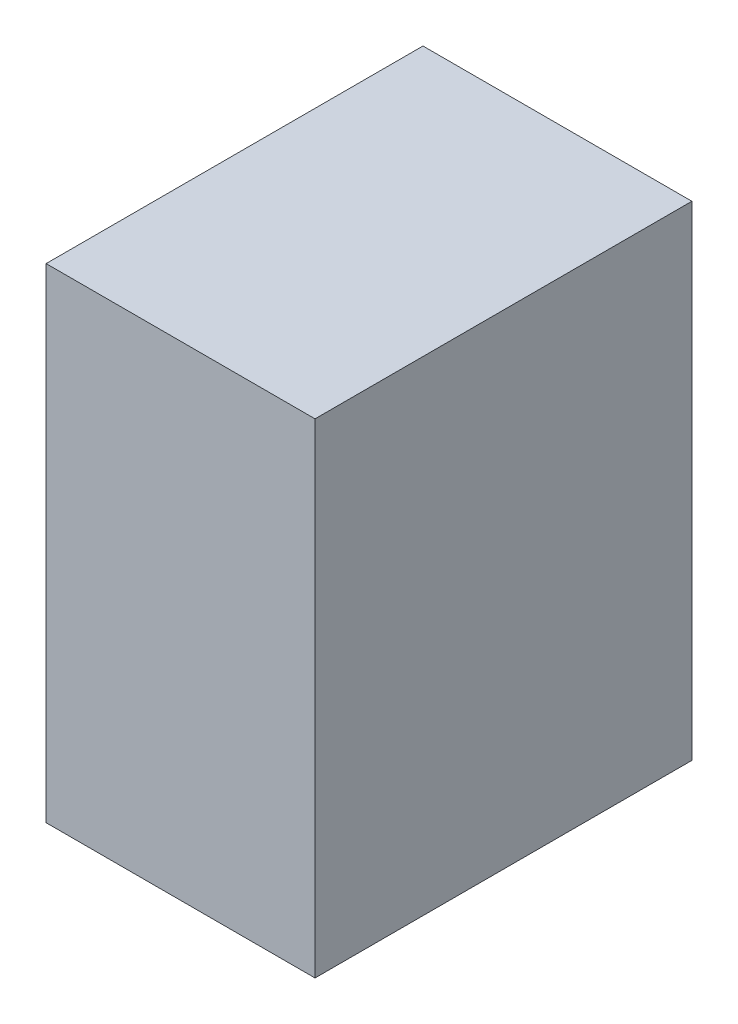
ISO-10303-21;
HEADER;
FILE_DESCRIPTION(('STEP AP214'),'2;1');
FILE_NAME('part.step','',(''),(''),'','','');
FILE_SCHEMA(('AUTOMOTIVE_DESIGN { 1 0 10303 214 1 1 1 1 }'));
ENDSEC;
DATA;
#1=APPLICATION_CONTEXT('core data for automotive mechanical design processes');
#2=APPLICATION_PROTOCOL_DEFINITION('international standard','automotive_design',2000,#1);
#3=PRODUCT_CONTEXT('',#1,'mechanical');
#4=PRODUCT('Part','Part','',(#3));
#5=PRODUCT_RELATED_PRODUCT_CATEGORY('part','',(#4));
#6=PRODUCT_DEFINITION_FORMATION('','',#4);
#7=PRODUCT_DEFINITION_CONTEXT('part definition',#1,'design');
#8=PRODUCT_DEFINITION('design','',#6,#7);
#9=PRODUCT_DEFINITION_SHAPE('','',#8);
#10=(LENGTH_UNIT() NAMED_UNIT(*) SI_UNIT(.MILLI.,.METRE.));
#11=(NAMED_UNIT(*) PLANE_ANGLE_UNIT() SI_UNIT($,.RADIAN.));
#12=(NAMED_UNIT(*) SI_UNIT($,.STERADIAN.) SOLID_ANGLE_UNIT());
#13=UNCERTAINTY_MEASURE_WITH_UNIT(LENGTH_MEASURE(1.E-05),#10,'distance_accuracy_value','');
#14=(GEOMETRIC_REPRESENTATION_CONTEXT(3) GLOBAL_UNCERTAINTY_ASSIGNED_CONTEXT((#13)) GLOBAL_UNIT_ASSIGNED_CONTEXT((#10,
#11,#12)) REPRESENTATION_CONTEXT('',''));
#15=CARTESIAN_POINT('',(0.,0.,0.));
#16=DIRECTION('',(0.,0.,1.));
#17=DIRECTION('',(1.,0.,0.));
#18=AXIS2_PLACEMENT_3D('',#15,#16,#17);
#19=CARTESIAN_POINT('',(-0.499491,0.89949274,1.39999974));
#20=DIRECTION('',(0.,0.,1.));
#21=DIRECTION('',(1.,0.,0.));
#22=AXIS2_PLACEMENT_3D('',#19,#20,#21);
#23=PLANE('',#22);
#24=DIRECTION('',(0.,1.,0.));
#25=VECTOR('',#24,1.);
#26=CARTESIAN_POINT('',(-0.499491,-0.89949274,1.39999974));
#27=LINE('',#26,#25);
#28=CARTESIAN_POINT('',(-0.499491,-0.89949274,1.39999974));
#29=VERTEX_POINT('',#28);
#30=CARTESIAN_POINT('',(-0.499491,0.89949274,1.39999974));
#31=VERTEX_POINT('',#30);
#32=EDGE_CURVE('E27',#29,#31,#27,.T.);
#33=ORIENTED_EDGE('',*,*,#32,.F.);
#34=DIRECTION('',(-1.,0.,0.));
#35=VECTOR('',#34,1.);
#36=CARTESIAN_POINT('',(0.499491,-0.89949274,1.39999974));
#37=LINE('',#36,#35);
#38=CARTESIAN_POINT('',(0.499491,-0.89949274,1.39999974));
#39=VERTEX_POINT('',#38);
#40=EDGE_CURVE('E108',#39,#29,#37,.T.);
#41=ORIENTED_EDGE('',*,*,#40,.F.);
#42=DIRECTION('',(0.,-1.,0.));
#43=VECTOR('',#42,1.);
#44=CARTESIAN_POINT('',(0.499491,0.89949274,1.39999974));
#45=LINE('',#44,#43);
#46=CARTESIAN_POINT('',(0.499491,0.89949274,1.39999974));
#47=VERTEX_POINT('',#46);
#48=EDGE_CURVE('E81',#47,#39,#45,.T.);
#49=ORIENTED_EDGE('',*,*,#48,.F.);
#50=DIRECTION('',(1.,0.,0.));
#51=VECTOR('',#50,1.);
#52=CARTESIAN_POINT('',(-0.499491,0.89949274,1.39999974));
#53=LINE('',#52,#51);
#54=EDGE_CURVE('E86',#31,#47,#53,.T.);
#55=ORIENTED_EDGE('',*,*,#54,.F.);
#56=EDGE_LOOP('',(#33,#41,#49,#55));
#57=FACE_BOUND('',#56,.T.);
#58=ADVANCED_FACE('F17',(#57),#23,.T.);
#59=CARTESIAN_POINT('',(-0.499491,0.89949274,0.));
#60=DIRECTION('',(0.,0.,1.));
#61=DIRECTION('',(1.,0.,0.));
#62=AXIS2_PLACEMENT_3D('',#59,#60,#61);
#63=PLANE('',#62);
#64=DIRECTION('',(1.,0.,0.));
#65=VECTOR('',#64,1.);
#66=CARTESIAN_POINT('',(-0.499491,0.89949274,0.));
#67=LINE('',#66,#65);
#68=CARTESIAN_POINT('',(-0.499491,0.89949274,0.));
#69=VERTEX_POINT('',#68);
#70=CARTESIAN_POINT('',(0.499491,0.89949274,0.));
#71=VERTEX_POINT('',#70);
#72=EDGE_CURVE('E68',#69,#71,#67,.T.);
#73=ORIENTED_EDGE('',*,*,#72,.T.);
#74=DIRECTION('',(0.,-1.,0.));
#75=VECTOR('',#74,1.);
#76=CARTESIAN_POINT('',(0.499491,0.89949274,0.));
#77=LINE('',#76,#75);
#78=CARTESIAN_POINT('',(0.499491,-0.89949274,0.));
#79=VERTEX_POINT('',#78);
#80=EDGE_CURVE('E105',#71,#79,#77,.T.);
#81=ORIENTED_EDGE('',*,*,#80,.T.);
#82=DIRECTION('',(-1.,0.,0.));
#83=VECTOR('',#82,1.);
#84=CARTESIAN_POINT('',(0.499491,-0.89949274,0.));
#85=LINE('',#84,#83);
#86=CARTESIAN_POINT('',(-0.499491,-0.89949274,0.));
#87=VERTEX_POINT('',#86);
#88=EDGE_CURVE('E71',#79,#87,#85,.T.);
#89=ORIENTED_EDGE('',*,*,#88,.T.);
#90=DIRECTION('',(0.,1.,0.));
#91=VECTOR('',#90,1.);
#92=CARTESIAN_POINT('',(-0.499491,-0.89949274,0.));
#93=LINE('',#92,#91);
#94=EDGE_CURVE('E11',#87,#69,#93,.T.);
#95=ORIENTED_EDGE('',*,*,#94,.T.);
#96=EDGE_LOOP('',(#73,#81,#89,#95));
#97=FACE_BOUND('',#96,.T.);
#98=ADVANCED_FACE('F66',(#97),#63,.F.);
#99=CARTESIAN_POINT('',(-0.499491,-0.89949274,0.));
#100=DIRECTION('',(-1.,0.,0.));
#101=DIRECTION('',(0.,0.,1.));
#102=AXIS2_PLACEMENT_3D('',#99,#100,#101);
#103=PLANE('',#102);
#104=DIRECTION('',(0.,0.,1.));
#105=VECTOR('',#104,1.);
#106=CARTESIAN_POINT('',(-0.499491,-0.89949274,0.));
#107=LINE('',#106,#105);
#108=EDGE_CURVE('E20',#87,#29,#107,.T.);
#109=ORIENTED_EDGE('',*,*,#108,.T.);
#110=ORIENTED_EDGE('',*,*,#32,.T.);
#111=DIRECTION('',(0.,0.,1.));
#112=VECTOR('',#111,1.);
#113=CARTESIAN_POINT('',(-0.499491,0.89949274,0.));
#114=LINE('',#113,#112);
#115=EDGE_CURVE('E77',#69,#31,#114,.T.);
#116=ORIENTED_EDGE('',*,*,#115,.F.);
#117=ORIENTED_EDGE('',*,*,#94,.F.);
#118=EDGE_LOOP('',(#109,#110,#116,#117));
#119=FACE_BOUND('',#118,.T.);
#120=ADVANCED_FACE('F83',(#119),#103,.T.);
#121=CARTESIAN_POINT('',(0.499491,-0.89949274,0.));
#122=DIRECTION('',(0.,-1.,0.));
#123=DIRECTION('',(0.,0.,-1.));
#124=AXIS2_PLACEMENT_3D('',#121,#122,#123);
#125=PLANE('',#124);
#126=DIRECTION('',(0.,0.,1.));
#127=VECTOR('',#126,1.);
#128=CARTESIAN_POINT('',(0.499491,-0.89949274,0.));
#129=LINE('',#128,#127);
#130=EDGE_CURVE('E101',#79,#39,#129,.T.);
#131=ORIENTED_EDGE('',*,*,#130,.T.);
#132=ORIENTED_EDGE('',*,*,#40,.T.);
#133=ORIENTED_EDGE('',*,*,#108,.F.);
#134=ORIENTED_EDGE('',*,*,#88,.F.);
#135=EDGE_LOOP('',(#131,#132,#133,#134));
#136=FACE_BOUND('',#135,.T.);
#137=ADVANCED_FACE('F118',(#136),#125,.T.);
#138=CARTESIAN_POINT('',(0.499491,0.89949274,0.));
#139=DIRECTION('',(1.,0.,0.));
#140=DIRECTION('',(0.,1.,0.));
#141=AXIS2_PLACEMENT_3D('',#138,#139,#140);
#142=PLANE('',#141);
#143=DIRECTION('',(0.,0.,1.));
#144=VECTOR('',#143,1.);
#145=CARTESIAN_POINT('',(0.499491,0.89949274,0.));
#146=LINE('',#145,#144);
#147=EDGE_CURVE('E79',#71,#47,#146,.T.);
#148=ORIENTED_EDGE('',*,*,#147,.T.);
#149=ORIENTED_EDGE('',*,*,#48,.T.);
#150=ORIENTED_EDGE('',*,*,#130,.F.);
#151=ORIENTED_EDGE('',*,*,#80,.F.);
#152=EDGE_LOOP('',(#148,#149,#150,#151));
#153=FACE_BOUND('',#152,.T.);
#154=ADVANCED_FACE('F121',(#153),#142,.T.);
#155=CARTESIAN_POINT('',(-0.499491,0.89949274,0.));
#156=DIRECTION('',(0.,1.,0.));
#157=DIRECTION('',(1.,0.,0.));
#158=AXIS2_PLACEMENT_3D('',#155,#156,#157);
#159=PLANE('',#158);
#160=ORIENTED_EDGE('',*,*,#115,.T.);
#161=ORIENTED_EDGE('',*,*,#54,.T.);
#162=ORIENTED_EDGE('',*,*,#147,.F.);
#163=ORIENTED_EDGE('',*,*,#72,.F.);
#164=EDGE_LOOP('',(#160,#161,#162,#163));
#165=FACE_BOUND('',#164,.T.);
#166=ADVANCED_FACE('F75',(#165),#159,.T.);
#167=CLOSED_SHELL('',(#58,#98,#120,#137,#154,#166));
#168=MANIFOLD_SOLID_BREP('B1',#167);
#169=ADVANCED_BREP_SHAPE_REPRESENTATION('',(#18,#168),#14);
#170=SHAPE_DEFINITION_REPRESENTATION(#9,#169);
ENDSEC;
END-ISO-10303-21;
